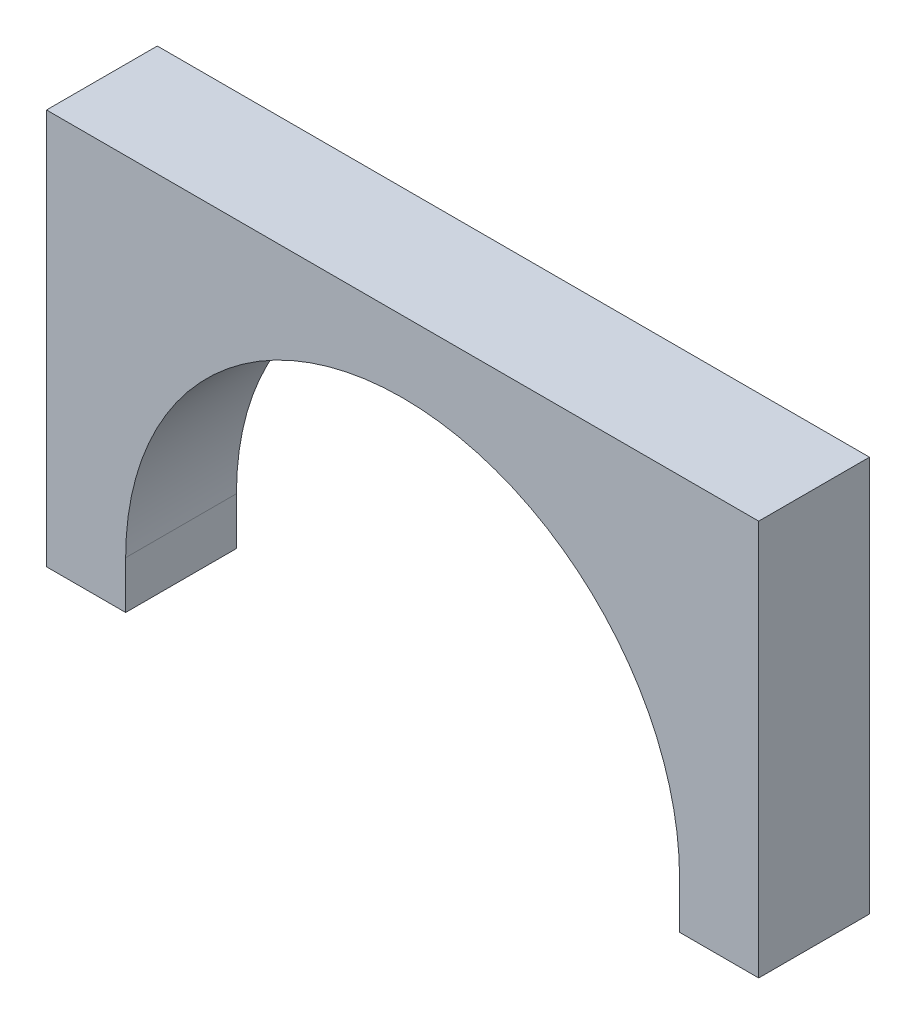
ISO-10303-21;
HEADER;
FILE_DESCRIPTION(('STEP AP214'),'2;1');
FILE_NAME('part.step','',(''),(''),'','','');
FILE_SCHEMA(('AUTOMOTIVE_DESIGN { 1 0 10303 214 1 1 1 1 }'));
ENDSEC;
DATA;
#1=APPLICATION_CONTEXT('core data for automotive mechanical design processes');
#2=APPLICATION_PROTOCOL_DEFINITION('international standard','automotive_design',2000,#1);
#3=PRODUCT_CONTEXT('',#1,'mechanical');
#4=PRODUCT('Part','Part','',(#3));
#5=PRODUCT_RELATED_PRODUCT_CATEGORY('part','',(#4));
#6=PRODUCT_DEFINITION_FORMATION('','',#4);
#7=PRODUCT_DEFINITION_CONTEXT('part definition',#1,'design');
#8=PRODUCT_DEFINITION('design','',#6,#7);
#9=PRODUCT_DEFINITION_SHAPE('','',#8);
#10=(LENGTH_UNIT() NAMED_UNIT(*) SI_UNIT(.MILLI.,.METRE.));
#11=(NAMED_UNIT(*) PLANE_ANGLE_UNIT() SI_UNIT($,.RADIAN.));
#12=(NAMED_UNIT(*) SI_UNIT($,.STERADIAN.) SOLID_ANGLE_UNIT());
#13=UNCERTAINTY_MEASURE_WITH_UNIT(LENGTH_MEASURE(1.E-05),#10,'distance_accuracy_value','');
#14=(GEOMETRIC_REPRESENTATION_CONTEXT(3) GLOBAL_UNCERTAINTY_ASSIGNED_CONTEXT((#13)) GLOBAL_UNIT_ASSIGNED_CONTEXT((#10,
#11,#12)) REPRESENTATION_CONTEXT('',''));
#15=CARTESIAN_POINT('',(0.,0.,0.));
#16=DIRECTION('',(0.,0.,1.));
#17=DIRECTION('',(1.,0.,0.));
#18=AXIS2_PLACEMENT_3D('',#15,#16,#17);
#19=CARTESIAN_POINT('',(22.5,0.,7.));
#20=DIRECTION('',(-1.,0.,0.));
#21=DIRECTION('',(0.,0.,1.));
#22=AXIS2_PLACEMENT_3D('',#19,#20,#21);
#23=PLANE('',#22);
#24=DIRECTION('',(0.,1.,0.));
#25=VECTOR('',#24,1.);
#26=CARTESIAN_POINT('',(22.5,0.,0.));
#27=LINE('',#26,#25);
#28=CARTESIAN_POINT('',(22.5,0.,0.));
#29=VERTEX_POINT('',#28);
#30=CARTESIAN_POINT('',(22.5,25.,0.));
#31=VERTEX_POINT('',#30);
#32=EDGE_CURVE('E128',#29,#31,#27,.T.);
#33=ORIENTED_EDGE('',*,*,#32,.T.);
#34=DIRECTION('',(0.,0.,-1.));
#35=VECTOR('',#34,1.);
#36=CARTESIAN_POINT('',(22.5,25.,7.));
#37=LINE('',#36,#35);
#38=CARTESIAN_POINT('',(22.5,25.,7.));
#39=VERTEX_POINT('',#38);
#40=EDGE_CURVE('E11',#39,#31,#37,.T.);
#41=ORIENTED_EDGE('',*,*,#40,.F.);
#42=DIRECTION('',(0.,1.,0.));
#43=VECTOR('',#42,1.);
#44=CARTESIAN_POINT('',(22.5,0.,7.));
#45=LINE('',#44,#43);
#46=CARTESIAN_POINT('',(22.5,0.,7.));
#47=VERTEX_POINT('',#46);
#48=EDGE_CURVE('E142',#47,#39,#45,.T.);
#49=ORIENTED_EDGE('',*,*,#48,.F.);
#50=DIRECTION('',(0.,0.,-1.));
#51=VECTOR('',#50,1.);
#52=CARTESIAN_POINT('',(22.5,0.,7.));
#53=LINE('',#52,#51);
#54=EDGE_CURVE('E124',#47,#29,#53,.T.);
#55=ORIENTED_EDGE('',*,*,#54,.T.);
#56=EDGE_LOOP('',(#33,#41,#49,#55));
#57=FACE_BOUND('',#56,.T.);
#58=ADVANCED_FACE('F32',(#57),#23,.F.);
#59=CARTESIAN_POINT('',(-22.5,25.,7.));
#60=DIRECTION('',(0.,-1.,0.));
#61=DIRECTION('',(0.,0.,-1.));
#62=AXIS2_PLACEMENT_3D('',#59,#60,#61);
#63=PLANE('',#62);
#64=DIRECTION('',(-1.,0.,0.));
#65=VECTOR('',#64,1.);
#66=CARTESIAN_POINT('',(-22.5,25.,0.));
#67=LINE('',#66,#65);
#68=CARTESIAN_POINT('',(-22.5,25.,0.));
#69=VERTEX_POINT('',#68);
#70=EDGE_CURVE('E131',#31,#69,#67,.T.);
#71=ORIENTED_EDGE('',*,*,#70,.T.);
#72=DIRECTION('',(0.,0.,-1.));
#73=VECTOR('',#72,1.);
#74=CARTESIAN_POINT('',(-22.5,25.,7.));
#75=LINE('',#74,#73);
#76=CARTESIAN_POINT('',(-22.5,25.,7.));
#77=VERTEX_POINT('',#76);
#78=EDGE_CURVE('E40',#77,#69,#75,.T.);
#79=ORIENTED_EDGE('',*,*,#78,.F.);
#80=DIRECTION('',(-1.,0.,0.));
#81=VECTOR('',#80,1.);
#82=CARTESIAN_POINT('',(-22.5,25.,7.));
#83=LINE('',#82,#81);
#84=EDGE_CURVE('E91',#39,#77,#83,.T.);
#85=ORIENTED_EDGE('',*,*,#84,.F.);
#86=ORIENTED_EDGE('',*,*,#40,.T.);
#87=EDGE_LOOP('',(#71,#79,#85,#86));
#88=FACE_BOUND('',#87,.T.);
#89=ADVANCED_FACE('F177',(#88),#63,.F.);
#90=CARTESIAN_POINT('',(-22.5,0.,7.));
#91=DIRECTION('',(1.,0.,0.));
#92=DIRECTION('',(0.,0.,-1.));
#93=AXIS2_PLACEMENT_3D('',#90,#91,#92);
#94=PLANE('',#93);
#95=DIRECTION('',(0.,-1.,0.));
#96=VECTOR('',#95,1.);
#97=CARTESIAN_POINT('',(-22.5,0.,0.));
#98=LINE('',#97,#96);
#99=CARTESIAN_POINT('',(-22.5,0.,0.));
#100=VERTEX_POINT('',#99);
#101=EDGE_CURVE('E133',#69,#100,#98,.T.);
#102=ORIENTED_EDGE('',*,*,#101,.T.);
#103=DIRECTION('',(0.,0.,-1.));
#104=VECTOR('',#103,1.);
#105=CARTESIAN_POINT('',(-22.5,0.,7.));
#106=LINE('',#105,#104);
#107=CARTESIAN_POINT('',(-22.5,0.,7.));
#108=VERTEX_POINT('',#107);
#109=EDGE_CURVE('E149',#108,#100,#106,.T.);
#110=ORIENTED_EDGE('',*,*,#109,.F.);
#111=DIRECTION('',(0.,-1.,0.));
#112=VECTOR('',#111,1.);
#113=CARTESIAN_POINT('',(-22.5,0.,7.));
#114=LINE('',#113,#112);
#115=EDGE_CURVE('E157',#77,#108,#114,.T.);
#116=ORIENTED_EDGE('',*,*,#115,.F.);
#117=ORIENTED_EDGE('',*,*,#78,.T.);
#118=EDGE_LOOP('',(#102,#110,#116,#117));
#119=FACE_BOUND('',#118,.T.);
#120=ADVANCED_FACE('F155',(#119),#94,.F.);
#121=CARTESIAN_POINT('',(-17.5,0.,7.));
#122=DIRECTION('',(0.,1.,0.));
#123=DIRECTION('',(-1.,0.,0.));
#124=AXIS2_PLACEMENT_3D('',#121,#122,#123);
#125=PLANE('',#124);
#126=DIRECTION('',(1.,0.,0.));
#127=VECTOR('',#126,1.);
#128=CARTESIAN_POINT('',(-17.5,0.,0.));
#129=LINE('',#128,#127);
#130=CARTESIAN_POINT('',(-17.5,0.,0.));
#131=VERTEX_POINT('',#130);
#132=EDGE_CURVE('E135',#100,#131,#129,.T.);
#133=ORIENTED_EDGE('',*,*,#132,.T.);
#134=DIRECTION('',(0.,0.,-1.));
#135=VECTOR('',#134,1.);
#136=CARTESIAN_POINT('',(-17.5,0.,7.));
#137=LINE('',#136,#135);
#138=CARTESIAN_POINT('',(-17.5,0.,7.));
#139=VERTEX_POINT('',#138);
#140=EDGE_CURVE('E146',#139,#131,#137,.T.);
#141=ORIENTED_EDGE('',*,*,#140,.F.);
#142=DIRECTION('',(1.,0.,0.));
#143=VECTOR('',#142,1.);
#144=CARTESIAN_POINT('',(-17.5,0.,7.));
#145=LINE('',#144,#143);
#146=EDGE_CURVE('E169',#108,#139,#145,.T.);
#147=ORIENTED_EDGE('',*,*,#146,.F.);
#148=ORIENTED_EDGE('',*,*,#109,.T.);
#149=EDGE_LOOP('',(#133,#141,#147,#148));
#150=FACE_BOUND('',#149,.T.);
#151=ADVANCED_FACE('F165',(#150),#125,.F.);
#152=CARTESIAN_POINT('',(-17.5,0.,7.));
#153=DIRECTION('',(-1.,0.,0.));
#154=DIRECTION('',(0.,0.,1.));
#155=AXIS2_PLACEMENT_3D('',#152,#153,#154);
#156=PLANE('',#155);
#157=DIRECTION('',(0.,1.,0.));
#158=VECTOR('',#157,1.);
#159=CARTESIAN_POINT('',(-17.5,0.,0.));
#160=LINE('',#159,#158);
#161=CARTESIAN_POINT('',(-17.5,3.,0.));
#162=VERTEX_POINT('',#161);
#163=EDGE_CURVE('E137',#131,#162,#160,.T.);
#164=ORIENTED_EDGE('',*,*,#163,.T.);
#165=DIRECTION('',(0.,0.,-1.));
#166=VECTOR('',#165,1.);
#167=CARTESIAN_POINT('',(-17.5,3.,7.));
#168=LINE('',#167,#166);
#169=CARTESIAN_POINT('',(-17.5,3.,7.));
#170=VERTEX_POINT('',#169);
#171=EDGE_CURVE('E119',#170,#162,#168,.T.);
#172=ORIENTED_EDGE('',*,*,#171,.F.);
#173=DIRECTION('',(0.,1.,0.));
#174=VECTOR('',#173,1.);
#175=CARTESIAN_POINT('',(-17.5,0.,7.));
#176=LINE('',#175,#174);
#177=EDGE_CURVE('E110',#139,#170,#176,.T.);
#178=ORIENTED_EDGE('',*,*,#177,.F.);
#179=ORIENTED_EDGE('',*,*,#140,.T.);
#180=EDGE_LOOP('',(#164,#172,#178,#179));
#181=FACE_BOUND('',#180,.T.);
#182=ADVANCED_FACE('F168',(#181),#156,.F.);
#183=CARTESIAN_POINT('',(0.,3.,7.));
#184=DIRECTION('',(0.,0.,-1.));
#185=DIRECTION('',(-1.,0.,0.));
#186=AXIS2_PLACEMENT_3D('',#183,#184,#185);
#187=CYLINDRICAL_SURFACE('',#186,17.5);
#188=CARTESIAN_POINT('',(0.,3.,0.));
#189=DIRECTION('',(0.,0.,-1.));
#190=DIRECTION('',(-1.,0.,0.));
#191=AXIS2_PLACEMENT_3D('',#188,#189,#190);
#192=CIRCLE('',#191,17.5);
#193=CARTESIAN_POINT('',(17.5,3.,0.));
#194=VERTEX_POINT('',#193);
#195=EDGE_CURVE('E118',#162,#194,#192,.T.);
#196=ORIENTED_EDGE('',*,*,#195,.T.);
#197=DIRECTION('',(0.,0.,-1.));
#198=VECTOR('',#197,1.);
#199=CARTESIAN_POINT('',(17.5,3.,7.));
#200=LINE('',#199,#198);
#201=CARTESIAN_POINT('',(17.5,3.,7.));
#202=VERTEX_POINT('',#201);
#203=EDGE_CURVE('E115',#202,#194,#200,.T.);
#204=ORIENTED_EDGE('',*,*,#203,.F.);
#205=CARTESIAN_POINT('',(0.,3.,7.));
#206=DIRECTION('',(0.,0.,-1.));
#207=DIRECTION('',(-1.,0.,0.));
#208=AXIS2_PLACEMENT_3D('',#205,#206,#207);
#209=CIRCLE('',#208,17.5);
#210=EDGE_CURVE('E104',#170,#202,#209,.T.);
#211=ORIENTED_EDGE('',*,*,#210,.F.);
#212=ORIENTED_EDGE('',*,*,#171,.T.);
#213=EDGE_LOOP('',(#196,#204,#211,#212));
#214=FACE_BOUND('',#213,.T.);
#215=ADVANCED_FACE('F116',(#214),#187,.F.);
#216=CARTESIAN_POINT('',(17.5,3.,7.));
#217=DIRECTION('',(1.,0.,0.));
#218=DIRECTION('',(0.,0.,-1.));
#219=AXIS2_PLACEMENT_3D('',#216,#217,#218);
#220=PLANE('',#219);
#221=DIRECTION('',(0.,-1.,0.));
#222=VECTOR('',#221,1.);
#223=CARTESIAN_POINT('',(17.5,3.,0.));
#224=LINE('',#223,#222);
#225=CARTESIAN_POINT('',(17.5,0.,0.));
#226=VERTEX_POINT('',#225);
#227=EDGE_CURVE('E77',#194,#226,#224,.T.);
#228=ORIENTED_EDGE('',*,*,#227,.T.);
#229=DIRECTION('',(0.,0.,-1.));
#230=VECTOR('',#229,1.);
#231=CARTESIAN_POINT('',(17.5,0.,7.));
#232=LINE('',#231,#230);
#233=CARTESIAN_POINT('',(17.5,0.,7.));
#234=VERTEX_POINT('',#233);
#235=EDGE_CURVE('E120',#234,#226,#232,.T.);
#236=ORIENTED_EDGE('',*,*,#235,.F.);
#237=DIRECTION('',(0.,-1.,0.));
#238=VECTOR('',#237,1.);
#239=CARTESIAN_POINT('',(17.5,3.,7.));
#240=LINE('',#239,#238);
#241=EDGE_CURVE('E108',#202,#234,#240,.T.);
#242=ORIENTED_EDGE('',*,*,#241,.F.);
#243=ORIENTED_EDGE('',*,*,#203,.T.);
#244=EDGE_LOOP('',(#228,#236,#242,#243));
#245=FACE_BOUND('',#244,.T.);
#246=ADVANCED_FACE('F122',(#245),#220,.F.);
#247=CARTESIAN_POINT('',(22.5,0.,7.));
#248=DIRECTION('',(0.,1.,0.));
#249=DIRECTION('',(-1.,0.,0.));
#250=AXIS2_PLACEMENT_3D('',#247,#248,#249);
#251=PLANE('',#250);
#252=DIRECTION('',(1.,0.,0.));
#253=VECTOR('',#252,1.);
#254=CARTESIAN_POINT('',(22.5,0.,0.));
#255=LINE('',#254,#253);
#256=EDGE_CURVE('E83',#226,#29,#255,.T.);
#257=ORIENTED_EDGE('',*,*,#256,.T.);
#258=ORIENTED_EDGE('',*,*,#54,.F.);
#259=DIRECTION('',(1.,0.,0.));
#260=VECTOR('',#259,1.);
#261=CARTESIAN_POINT('',(22.5,0.,7.));
#262=LINE('',#261,#260);
#263=EDGE_CURVE('E48',#234,#47,#262,.T.);
#264=ORIENTED_EDGE('',*,*,#263,.F.);
#265=ORIENTED_EDGE('',*,*,#235,.T.);
#266=EDGE_LOOP('',(#257,#258,#264,#265));
#267=FACE_BOUND('',#266,.T.);
#268=ADVANCED_FACE('F193',(#267),#251,.F.);
#269=CARTESIAN_POINT('',(0.,3.,7.));
#270=DIRECTION('',(0.,0.,-1.));
#271=DIRECTION('',(-1.,0.,0.));
#272=AXIS2_PLACEMENT_3D('',#269,#270,#271);
#273=PLANE('',#272);
#274=ORIENTED_EDGE('',*,*,#48,.T.);
#275=ORIENTED_EDGE('',*,*,#84,.T.);
#276=ORIENTED_EDGE('',*,*,#115,.T.);
#277=ORIENTED_EDGE('',*,*,#146,.T.);
#278=ORIENTED_EDGE('',*,*,#177,.T.);
#279=ORIENTED_EDGE('',*,*,#210,.T.);
#280=ORIENTED_EDGE('',*,*,#241,.T.);
#281=ORIENTED_EDGE('',*,*,#263,.T.);
#282=EDGE_LOOP('',(#274,#275,#276,#277,#278,#279,#280,#281));
#283=FACE_BOUND('',#282,.T.);
#284=ADVANCED_FACE('F106',(#283),#273,.F.);
#285=CARTESIAN_POINT('',(0.,3.,0.));
#286=DIRECTION('',(0.,0.,-1.));
#287=DIRECTION('',(-1.,0.,0.));
#288=AXIS2_PLACEMENT_3D('',#285,#286,#287);
#289=PLANE('',#288);
#290=ORIENTED_EDGE('',*,*,#32,.F.);
#291=ORIENTED_EDGE('',*,*,#256,.F.);
#292=ORIENTED_EDGE('',*,*,#227,.F.);
#293=ORIENTED_EDGE('',*,*,#195,.F.);
#294=ORIENTED_EDGE('',*,*,#163,.F.);
#295=ORIENTED_EDGE('',*,*,#132,.F.);
#296=ORIENTED_EDGE('',*,*,#101,.F.);
#297=ORIENTED_EDGE('',*,*,#70,.F.);
#298=EDGE_LOOP('',(#290,#291,#292,#293,#294,#295,#296,#297));
#299=FACE_BOUND('',#298,.T.);
#300=ADVANCED_FACE('F161',(#299),#289,.T.);
#301=CLOSED_SHELL('',(#58,#89,#120,#151,#182,#215,#246,#268,#284,#300));
#302=MANIFOLD_SOLID_BREP('B2',#301);
#303=ADVANCED_BREP_SHAPE_REPRESENTATION('',(#18,#302),#14);
#304=SHAPE_DEFINITION_REPRESENTATION(#9,#303);
ENDSEC;
END-ISO-10303-21;
